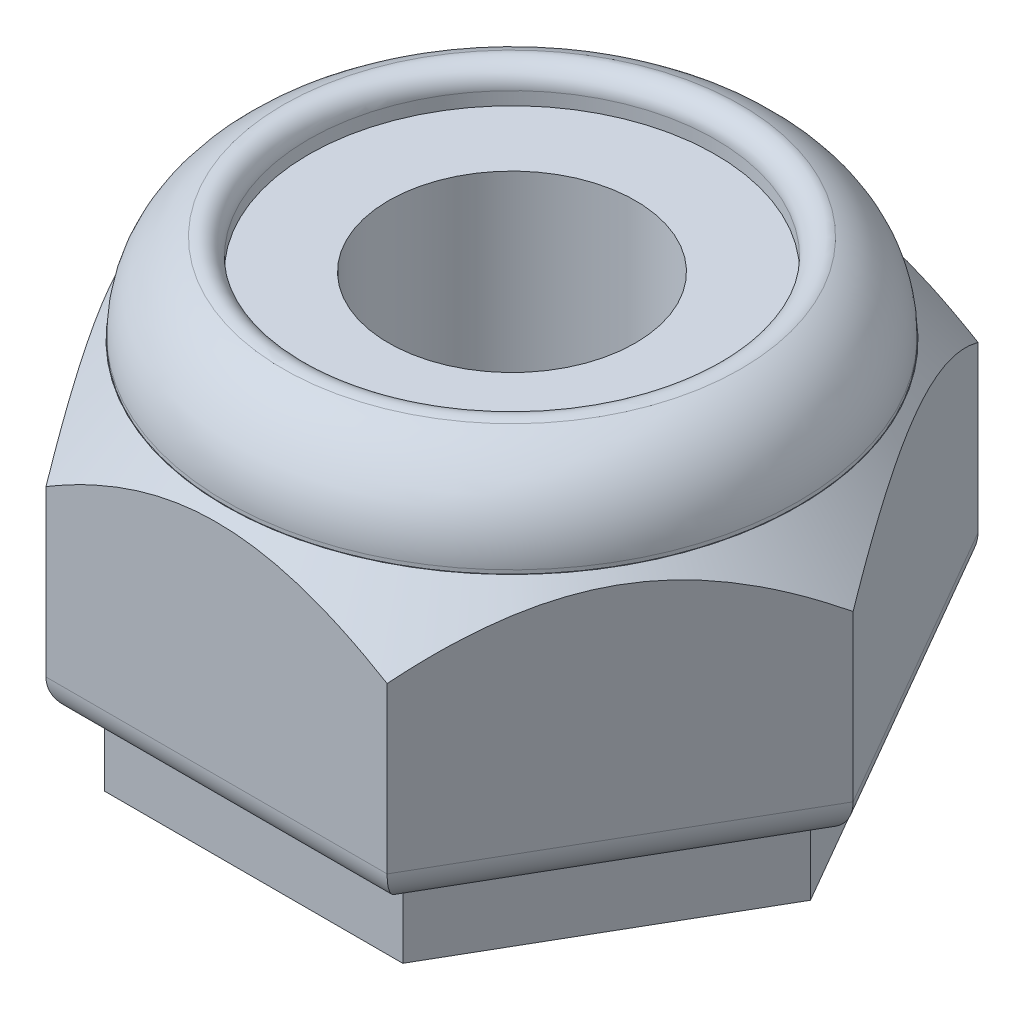
ISO-10303-21;
HEADER;
FILE_DESCRIPTION(('STEP AP214'),'2;1');
FILE_NAME('part.step','',(''),(''),'','','');
FILE_SCHEMA(('AUTOMOTIVE_DESIGN { 1 0 10303 214 1 1 1 1 }'));
ENDSEC;
DATA;
#1=APPLICATION_CONTEXT('core data for automotive mechanical design processes');
#2=APPLICATION_PROTOCOL_DEFINITION('international standard','automotive_design',2000,#1);
#3=PRODUCT_CONTEXT('',#1,'mechanical');
#4=PRODUCT('Part','Part','',(#3));
#5=PRODUCT_RELATED_PRODUCT_CATEGORY('part','',(#4));
#6=PRODUCT_DEFINITION_FORMATION('','',#4);
#7=PRODUCT_DEFINITION_CONTEXT('part definition',#1,'design');
#8=PRODUCT_DEFINITION('design','',#6,#7);
#9=PRODUCT_DEFINITION_SHAPE('','',#8);
#10=(LENGTH_UNIT() NAMED_UNIT(*) SI_UNIT(.MILLI.,.METRE.));
#11=(NAMED_UNIT(*) PLANE_ANGLE_UNIT() SI_UNIT($,.RADIAN.));
#12=(NAMED_UNIT(*) SI_UNIT($,.STERADIAN.) SOLID_ANGLE_UNIT());
#13=UNCERTAINTY_MEASURE_WITH_UNIT(LENGTH_MEASURE(1.E-05),#10,'distance_accuracy_value','');
#14=(GEOMETRIC_REPRESENTATION_CONTEXT(3) GLOBAL_UNCERTAINTY_ASSIGNED_CONTEXT((#13)) GLOBAL_UNIT_ASSIGNED_CONTEXT((#10,
#11,#12)) REPRESENTATION_CONTEXT('',''));
#15=CARTESIAN_POINT('',(0.,0.,0.));
#16=DIRECTION('',(0.,0.,1.));
#17=DIRECTION('',(1.,0.,0.));
#18=AXIS2_PLACEMENT_3D('',#15,#16,#17);
#19=CARTESIAN_POINT('',(0.,4.97840000000001,0.));
#20=DIRECTION('',(0.,-1.,0.));
#21=DIRECTION('',(1.,0.,0.));
#22=AXIS2_PLACEMENT_3D('',#19,#20,#21);
#23=CYLINDRICAL_SURFACE('',#22,3.93700000000001);
#24=CARTESIAN_POINT('',(0.,3.7084,0.));
#25=DIRECTION('',(0.,1.,0.));
#26=DIRECTION('',(-1.,0.,0.));
#27=AXIS2_PLACEMENT_3D('',#24,#25,#26);
#28=CIRCLE('',#27,3.937);
#29=CARTESIAN_POINT('',(-3.937,3.7084,0.));
#30=VERTEX_POINT('',#29);
#31=EDGE_CURVE('E142',#30,#30,#28,.T.);
#32=ORIENTED_EDGE('',*,*,#31,.F.);
#33=EDGE_LOOP('',(#32));
#34=FACE_BOUND('',#33,.T.);
#35=CARTESIAN_POINT('',(0.,3.6576,0.));
#36=DIRECTION('',(0.,-1.,0.));
#37=DIRECTION('',(1.,0.,0.));
#38=AXIS2_PLACEMENT_3D('',#35,#36,#37);
#39=CIRCLE('',#38,3.93700000000001);
#40=CARTESIAN_POINT('',(3.93700000000001,3.6576,0.));
#41=VERTEX_POINT('',#40);
#42=EDGE_CURVE('E20',#41,#41,#39,.F.);
#43=ORIENTED_EDGE('',*,*,#42,.T.);
#44=EDGE_LOOP('',(#43));
#45=FACE_BOUND('',#44,.T.);
#46=ADVANCED_FACE('F16',(#34,#45),#23,.T.);
#47=CARTESIAN_POINT('',(2.34315000000001,3.6576,4.05845484975502));
#48=DIRECTION('',(0.,-1.,0.));
#49=DIRECTION('',(1.,0.,0.));
#50=AXIS2_PLACEMENT_3D('',#47,#48,#49);
#51=PLANE('',#50);
#52=CARTESIAN_POINT('',(0.,3.65760000016735,0.));
#53=DIRECTION('',(0.,-1.,0.));
#54=DIRECTION('',(0.,0.,-1.));
#55=AXIS2_PLACEMENT_3D('',#52,#53,#54);
#56=CIRCLE('',#55,3.94407100938664);
#57=CARTESIAN_POINT('',(0.,3.65760000016735,-3.94407100938664));
#58=VERTEX_POINT('',#57);
#59=EDGE_CURVE('E141',#58,#58,#56,.T.);
#60=ORIENTED_EDGE('',*,*,#59,.F.);
#61=EDGE_LOOP('',(#60));
#62=FACE_BOUND('',#61,.T.);
#63=ORIENTED_EDGE('',*,*,#42,.F.);
#64=EDGE_LOOP('',(#63));
#65=FACE_BOUND('',#64,.T.);
#66=ADVANCED_FACE('F198',(#62,#65),#51,.F.);
#67=CARTESIAN_POINT('',(0.,3.70840000000008,0.));
#68=DIRECTION('',(0.,1.,0.));
#69=DIRECTION('',(0.,0.,1.));
#70=AXIS2_PLACEMENT_3D('',#67,#68,#69);
#71=TOROIDAL_SURFACE('',#70,2.66699999999999,1.27000000000001);
#72=ORIENTED_EDGE('',*,*,#31,.T.);
#73=EDGE_LOOP('',(#72));
#74=FACE_BOUND('',#73,.T.);
#75=CARTESIAN_POINT('',(0.,4.88572150982652,0.));
#76=DIRECTION('',(0.,1.,0.));
#77=DIRECTION('',(-1.,0.,0.));
#78=AXIS2_PLACEMENT_3D('',#75,#76,#77);
#79=CIRCLE('',#78,3.14325000000004);
#80=CARTESIAN_POINT('',(-3.14325000000003,4.88572150982652,0.));
#81=VERTEX_POINT('',#80);
#82=EDGE_CURVE('E121',#81,#81,#79,.T.);
#83=ORIENTED_EDGE('',*,*,#82,.F.);
#84=EDGE_LOOP('',(#83));
#85=FACE_BOUND('',#84,.T.);
#86=ADVANCED_FACE('F195',(#74,#85),#71,.T.);
#87=CARTESIAN_POINT('',(0.,2.76773860986168,0.));
#88=DIRECTION('',(0.,-1.,0.));
#89=DIRECTION('',(0.,0.,-1.));
#90=AXIS2_PLACEMENT_3D('',#87,#88,#89);
#91=CONICAL_SURFACE('',#90,4.69075337383629,0.698131700827581);
#92=CARTESIAN_POINT('',(-4.68630000002063,2.77304593408968,-5.5851817155357E-11));
#93=CARTESIAN_POINT('',(-4.65177717141987,2.81418235899122,0.0597952931143583));
#94=CARTESIAN_POINT('',(-4.61695780288894,2.85432113120693,0.120104208502788));
#95=CARTESIAN_POINT('',(-4.54666264441,2.93230661030783,0.241858994518482));
#96=CARTESIAN_POINT('',(-4.51118655193937,2.9701522247184,0.303305389130307));
#97=CARTESIAN_POINT('',(-4.40329561884235,3.0801870150985,0.490177966928205));
#98=CARTESIAN_POINT('',(-4.32983334003035,3.14837015585763,0.617418366271436));
#99=CARTESIAN_POINT('',(-4.17977964995295,3.27092778618679,0.877318981349457));
#100=CARTESIAN_POINT('',(-4.10317943930135,3.32525984895606,1.00999443806823));
#101=CARTESIAN_POINT('',(-3.94747591648453,3.41577217654512,1.2796808505042));
#102=CARTESIAN_POINT('',(-3.86837998240626,3.45200143021415,1.41667902699998));
#103=CARTESIAN_POINT('',(-3.73746585192525,3.49372811251008,1.64342895242181));
#104=CARTESIAN_POINT('',(-3.68614686015525,3.50560413722607,1.73231605356066));
#105=CARTESIAN_POINT('',(-3.58316406703978,3.52008140709636,1.910687483542));
#106=CARTESIAN_POINT('',(-3.53150020829175,3.52268106759616,2.00017191180866));
#107=CARTESIAN_POINT('',(-3.4285503454563,3.51847006530652,2.1784863048719));
#108=CARTESIAN_POINT('',(-3.37726380879505,3.51171021123823,2.26731719211343));
#109=CARTESIAN_POINT('',(-3.27519197702569,3.48921023560211,2.44411079075957));
#110=CARTESIAN_POINT('',(-3.224406707084,3.47346966546141,2.53207345857468));
#111=CARTESIAN_POINT('',(-3.10963060126893,3.42817062225528,2.73087150534129));
#112=CARTESIAN_POINT('',(-3.04589899568911,3.39598542078789,2.84125788425347));
#113=CARTESIAN_POINT('',(-2.92018166730183,3.32004827847368,3.05900668441208));
#114=CARTESIAN_POINT('',(-2.85819691952129,3.27629001415344,3.16636741686231));
#115=CARTESIAN_POINT('',(-2.7358890681865,3.1791036138555,3.37821082953874));
#116=CARTESIAN_POINT('',(-2.67557364726428,3.12563730729643,3.48268020305593));
#117=CARTESIAN_POINT('',(-2.55683004307658,3.01104764605198,3.68835015858288));
#118=CARTESIAN_POINT('',(-2.49840123076285,2.94992687744367,3.78955183013616));
#119=CARTESIAN_POINT('',(-2.42439626080902,2.86741854621722,3.91773219810881));
#120=CARTESIAN_POINT('',(-2.40802320097242,2.84883596647861,3.94609116962116));
#121=CARTESIAN_POINT('',(-2.3754621575828,2.81125673911825,4.00248855111944));
#122=CARTESIAN_POINT('',(-2.35927376439136,2.7922615116873,4.03052767061991));
#123=CARTESIAN_POINT('',(-2.34314999996957,2.77304593409365,4.05845484980773));
#124=B_SPLINE_CURVE_WITH_KNOTS('',3,(#92,#93,#94,#95,#96,#97,#98,#99,#100,#101,#102,#103,#104,
#105,#106,#107,#108,#109,#110,#111,#112,#113,#114,#115,#116,#117,#118,#119,#120,#121,#122,#123),
.UNSPECIFIED.,.F.,.F.,(4,2,2,2,2,2,2,2,2,2,2,2,2,2,2,4),(0.,0.241096809096306,0.482307589468028,
0.967637153878541,1.45443592247298,1.93991010962832,2.24950193441283,2.55914664334294,
2.86711700082692,3.17510274230014,3.56882084728694,3.96275452424868,4.35827201956431,
4.75365624709085,4.86660838996671,4.97921936903169),.UNSPECIFIED.);
#125=CARTESIAN_POINT('',(-4.68630000003129,2.77304593409263,1.36258849487727E-12));
#126=VERTEX_POINT('',#125);
#127=CARTESIAN_POINT('',(-2.34314999998476,2.77304593411176,4.05845484978141));
#128=VERTEX_POINT('',#127);
#129=EDGE_CURVE('E107',#126,#128,#124,.T.);
#130=ORIENTED_EDGE('',*,*,#129,.T.);
#131=CARTESIAN_POINT('',(-2.34315000006155,2.77304593408735,4.0584548497437));
#132=CARTESIAN_POINT('',(-2.27415972170866,2.81414935281164,4.05845484975083));
#133=CARTESIAN_POINT('',(-2.20457738522182,2.85425669894478,4.05845484975385));
#134=CARTESIAN_POINT('',(-2.06410193527611,2.93218331977878,4.05845484975614));
#135=CARTESIAN_POINT('',(-1.99320821640363,2.9700015014107,4.05845484975539));
#136=CARTESIAN_POINT('',(-1.77754688770714,3.07999086395974,4.05845484975419));
#137=CARTESIAN_POINT('',(-1.63068545867608,3.14815894046428,4.05845484975478));
#138=CARTESIAN_POINT('',(-1.3305275245436,3.27077676928304,4.05845484975521));
#139=CARTESIAN_POINT('',(-1.17720631605115,3.32516696813021,4.05845484975505));
#140=CARTESIAN_POINT('',(-0.86561350375334,3.41574608774384,4.05845484975494));
#141=CARTESIAN_POINT('',(-0.707359229251527,3.45199244882939,4.05845484975499));
#142=CARTESIAN_POINT('',(-0.456822143289689,3.49192146554132,4.058454849755));
#143=CARTESIAN_POINT('',(-0.365672921111748,3.50290887302486,4.058454849755));
#144=CARTESIAN_POINT('',(-0.183016321982132,3.51758027920227,4.058454849755));
#145=CARTESIAN_POINT('',(-0.0915105175139071,3.52128341043631,4.058454849755));
#146=CARTESIAN_POINT('',(0.104649468639837,3.52128177498356,4.058454849755));
#147=CARTESIAN_POINT('',(0.209305100868819,3.51643705340132,4.058454849755));
#148=CARTESIAN_POINT('',(0.417787181903716,3.49730239566766,4.058454849755));
#149=CARTESIAN_POINT('',(0.521613181345373,3.48300765118378,4.058454849755));
#150=CARTESIAN_POINT('',(0.728332544903489,3.44553375893286,4.058454849755));
#151=CARTESIAN_POINT('',(0.831215331547278,3.4222969773141,4.058454849755));
#152=CARTESIAN_POINT('',(1.03487580389782,3.36791830062304,4.058454849755));
#153=CARTESIAN_POINT('',(1.13565289467374,3.33677420329568,4.058454849755));
#154=CARTESIAN_POINT('',(1.33273383820815,3.26838741926302,4.058454849755));
#155=CARTESIAN_POINT('',(1.42908716224858,3.23128582693013,4.058454849755));
#156=CARTESIAN_POINT('',(1.61947291707491,3.15151071600647,4.058454849755));
#157=CARTESIAN_POINT('',(1.71350470709176,3.10883567908223,4.058454849755));
#158=CARTESIAN_POINT('',(1.89803195382149,3.01941532340772,4.058454849755));
#159=CARTESIAN_POINT('',(1.98855798046384,2.9727325573531,4.058454849755));
#160=CARTESIAN_POINT('',(2.16742834958516,2.87556944094008,4.058454849755));
#161=CARTESIAN_POINT('',(2.25577492893011,2.8250932194195,4.058454849755));
#162=CARTESIAN_POINT('',(2.34315000006327,2.77304593409223,4.058454849755));
#163=B_SPLINE_CURVE_WITH_KNOTS('',3,(#131,#132,#133,#134,#135,#136,#137,#138,#139,#140,#141,
#142,#143,#144,#145,#146,#147,#148,#149,#150,#151,#152,#153,#154,#155,#156,#157,#158,#159,#160,
#161,#162),.UNSPECIFIED.,.F.,.F.,(4,2,2,2,2,2,2,2,2,2,2,2,2,2,2,4),(0.,0.240903303567016,
0.481920744751272,0.967059466998938,1.45426068379578,1.93990959183257,2.21507934698528,
2.48952538388813,2.80337599595386,3.11738642358903,3.43345557970446,3.74961286053018,
4.05916118105052,4.36879400618447,4.67425708544416,4.97939238066899),.UNSPECIFIED.);
#164=CARTESIAN_POINT('',(2.34315000001685,2.77304593409264,4.05845484978141));
#165=VERTEX_POINT('',#164);
#166=EDGE_CURVE('E175',#128,#165,#163,.T.);
#167=ORIENTED_EDGE('',*,*,#166,.T.);
#168=CARTESIAN_POINT('',(2.34314999996197,2.77304593408969,4.05845484980079));
#169=CARTESIAN_POINT('',(2.37767282857373,2.81418235899124,3.99865955663693));
#170=CARTESIAN_POINT('',(2.41249219710932,2.85432113120694,3.93835064125119));
#171=CARTESIAN_POINT('',(2.48278735559178,2.93230661030784,3.81659585523753));
#172=CARTESIAN_POINT('',(2.51826344806127,2.97015222471841,3.75514946062505));
#173=CARTESIAN_POINT('',(2.62615438115643,3.0801870150985,3.56827688282608));
#174=CARTESIAN_POINT('',(2.69961665996934,3.14837015585764,3.44103648348338));
#175=CARTESIAN_POINT('',(2.8496703500474,3.27092778618679,3.18113586840574));
#176=CARTESIAN_POINT('',(2.92627056069876,3.32525984895606,3.04846041168683));
#177=CARTESIAN_POINT('',(3.08197408351539,3.41577217654512,2.77877399925076));
#178=CARTESIAN_POINT('',(3.16107001759374,3.45200143021415,2.64177582275502));
#179=CARTESIAN_POINT('',(3.29198414807477,3.49372811251008,2.4150258973332));
#180=CARTESIAN_POINT('',(3.34330313984477,3.50560413722607,2.32613879619435));
#181=CARTESIAN_POINT('',(3.44628593296023,3.52008140709636,2.147767366213));
#182=CARTESIAN_POINT('',(3.49794979170827,3.52268106759615,2.05828293794635));
#183=CARTESIAN_POINT('',(3.60089965454371,3.51847006530651,1.87996854488311));
#184=CARTESIAN_POINT('',(3.65218619120497,3.51171021123823,1.79113765764158));
#185=CARTESIAN_POINT('',(3.75425802297432,3.48921023560211,1.61434405899544));
#186=CARTESIAN_POINT('',(3.80504329291601,3.47346966546141,1.52638139118033));
#187=CARTESIAN_POINT('',(3.91981939873108,3.42817062225528,1.32758334441373));
#188=CARTESIAN_POINT('',(3.98355100431089,3.39598542078789,1.21719696550155));
#189=CARTESIAN_POINT('',(4.10926833269818,3.32004827847368,0.999448165342945));
#190=CARTESIAN_POINT('',(4.17125308047872,3.27629001415344,0.892087432892712));
#191=CARTESIAN_POINT('',(4.2935609318135,3.17910361385551,0.680244020216284));
#192=CARTESIAN_POINT('',(4.35387635273573,3.12563730729643,0.575774646699087));
#193=CARTESIAN_POINT('',(4.47261995692343,3.01104764605197,0.370104691172138));
#194=CARTESIAN_POINT('',(4.53104876923716,2.94992687744367,0.268903019618855));
#195=CARTESIAN_POINT('',(4.60505373919152,2.86741854621663,0.14072265164529));
#196=CARTESIAN_POINT('',(4.62142679902863,2.84883596647742,0.112363680132042));
#197=CARTESIAN_POINT('',(4.65398784241929,2.81125673911583,0.055966298631973));
#198=CARTESIAN_POINT('',(4.67017623561123,2.79226151168425,0.0279271791306273));
#199=CARTESIAN_POINT('',(4.68630000003353,2.77304593408996,-5.80666998558344E-11));
#200=B_SPLINE_CURVE_WITH_KNOTS('',3,(#168,#169,#170,#171,#172,#173,#174,#175,#176,#177,#178,
#179,#180,#181,#182,#183,#184,#185,#186,#187,#188,#189,#190,#191,#192,#193,#194,#195,#196,#197,
#198,#199),.UNSPECIFIED.,.F.,.F.,(4,2,2,2,2,2,2,2,2,2,2,2,2,2,2,4),(0.,0.241096809096303,
0.482307589468021,0.967637153878527,1.45443592247296,1.9399101096283,2.24950193441281,
2.55914664334292,2.8671170008269,3.17510274230012,3.56882084728691,3.96275452424864,
4.35827201956428,4.75365624709083,4.86660838997029,4.97921936903886),.UNSPECIFIED.);
#201=CARTESIAN_POINT('',(4.68630000002732,2.77304593409736,-1.0917840877275E-11));
#202=VERTEX_POINT('',#201);
#203=EDGE_CURVE('E182',#165,#202,#200,.T.);
#204=ORIENTED_EDGE('',*,*,#203,.T.);
#205=CARTESIAN_POINT('',(4.68630000001692,2.77304593410323,3.76267458844408E-11));
#206=CARTESIAN_POINT('',(4.65177717141278,2.8141823590028,-0.0597952931310414));
#207=CARTESIAN_POINT('',(4.61695780288054,2.85432113121737,-0.120104208518577));
#208=CARTESIAN_POINT('',(4.54666264440093,2.93230661031677,-0.241858994533079));
#209=CARTESIAN_POINT('',(4.51118655193091,2.97015222472698,-0.303305389144605));
#210=CARTESIAN_POINT('',(4.40329561883524,3.08018701510582,-0.490177966941427));
#211=CARTESIAN_POINT('',(4.32983334002344,3.14837015586387,-0.617418366283689));
#212=CARTESIAN_POINT('',(4.17977964994688,3.27092778619112,-0.877318981359809));
#213=CARTESIAN_POINT('',(4.10317943929591,3.32525984895958,-1.00999443807765));
#214=CARTESIAN_POINT('',(3.94747591648032,3.41577217654717,-1.27968085051162));
#215=CARTESIAN_POINT('',(3.86837998240263,3.45200143021556,-1.41667902700633));
#216=CARTESIAN_POINT('',(3.73746585192226,3.49372811251083,-1.64342895242706));
#217=CARTESIAN_POINT('',(3.68614686015226,3.50560413722664,-1.7323160535659));
#218=CARTESIAN_POINT('',(3.58316406703681,3.52008140709656,-1.91068748354721));
#219=CARTESIAN_POINT('',(3.53150020828879,3.52268106759618,-2.00017191181384));
#220=CARTESIAN_POINT('',(3.42855034545338,3.51847006530618,-2.17848630487702));
#221=CARTESIAN_POINT('',(3.37726380879215,3.51171021123772,-2.26731719211852));
#222=CARTESIAN_POINT('',(3.27519197702284,3.48921023560127,-2.44411079076458));
#223=CARTESIAN_POINT('',(3.22440670708118,3.47346966546041,-2.53207345857964));
#224=CARTESIAN_POINT('',(3.10963060126602,3.42817062225387,-2.73087150534641));
#225=CARTESIAN_POINT('',(3.04589899568608,3.39598542078622,-2.84125788425879));
#226=CARTESIAN_POINT('',(2.92018166729857,3.32004827847145,-3.05900668441778));
#227=CARTESIAN_POINT('',(2.85819691951793,3.27629001415092,-3.1663674168682));
#228=CARTESIAN_POINT('',(2.73588906818295,3.17910361385241,-3.37821082954497));
#229=CARTESIAN_POINT('',(2.67557364726063,3.12563730729304,-3.48268020306233));
#230=CARTESIAN_POINT('',(2.55683004307275,3.01104764604801,-3.68835015858959));
#231=CARTESIAN_POINT('',(2.49840123075893,2.94992687743942,-3.78955183014302));
#232=CARTESIAN_POINT('',(2.42439626080543,2.8674185462131,-3.91773219811509));
#233=CARTESIAN_POINT('',(2.40802320096925,2.84883596647492,-3.94609116962672));
#234=CARTESIAN_POINT('',(2.37546215758045,2.81125673911543,-4.00248855112358));
#235=CARTESIAN_POINT('',(2.35927376438942,2.79226151168493,-4.03052767062335));
#236=CARTESIAN_POINT('',(2.34314999996803,2.77304593409174,-4.05845484981047));
#237=B_SPLINE_CURVE_WITH_KNOTS('',3,(#205,#206,#207,#208,#209,#210,#211,#212,#213,#214,#215,
#216,#217,#218,#219,#220,#221,#222,#223,#224,#225,#226,#227,#228,#229,#230,#231,#232,#233,#234,
#235,#236),.UNSPECIFIED.,.F.,.F.,(4,2,2,2,2,2,2,2,2,2,2,2,2,2,2,4),(0.,0.241096809094276,
0.482307589464009,0.967637153870556,1.45443592246103,1.93991010961239,2.2495019343968,
2.55914664332681,2.86711700081071,3.17510274228384,3.56882084727151,3.96275452423413,
4.35827201955063,4.75365624707804,4.86660838995109,4.97921936901329),.UNSPECIFIED.);
#238=CARTESIAN_POINT('',(2.34315000001448,2.77304593409259,-4.05845484978282));
#239=VERTEX_POINT('',#238);
#240=EDGE_CURVE('E202',#202,#239,#237,.T.);
#241=ORIENTED_EDGE('',*,*,#240,.T.);
#242=CARTESIAN_POINT('',(2.34315000005868,2.77304593408962,-4.058454849745));
#243=CARTESIAN_POINT('',(2.2741597217057,2.81414935281353,-4.05845484975135));
#244=CARTESIAN_POINT('',(2.20457738521886,2.85425669894645,-4.05845484975405));
#245=CARTESIAN_POINT('',(2.06410193527325,2.93218331978018,-4.05845484975609));
#246=CARTESIAN_POINT('',(1.99320821640086,2.97000150141205,-4.05845484975542));
#247=CARTESIAN_POINT('',(1.77754688770464,3.07999086396089,-4.05845484975435));
#248=CARTESIAN_POINT('',(1.63068545867372,3.14815894046526,-4.05845484975488));
#249=CARTESIAN_POINT('',(1.33052752454156,3.2707767692837,-4.05845484975526));
#250=CARTESIAN_POINT('',(1.17720631604929,3.32516696813074,-4.05845484975512));
#251=CARTESIAN_POINT('',(0.865613503751842,3.41574608774412,-4.05845484975502));
#252=CARTESIAN_POINT('',(0.707359229250219,3.45199244882957,-4.05845484975506));
#253=CARTESIAN_POINT('',(0.456822143288761,3.49192146554135,-4.05845484975507));
#254=CARTESIAN_POINT('',(0.365672921111005,3.50290887302485,-4.05845484975507));
#255=CARTESIAN_POINT('',(0.183016321981762,3.5175802792022,-4.05845484975507));
#256=CARTESIAN_POINT('',(0.0915105175137235,3.52128341043623,-4.05845484975507));
#257=CARTESIAN_POINT('',(-0.104649468639836,3.52128177498348,-4.05845484975507));
#258=CARTESIAN_POINT('',(-0.209305100868819,3.51643705340124,-4.05845484975507));
#259=CARTESIAN_POINT('',(-0.41778718190372,3.49730239566758,-4.05845484975507));
#260=CARTESIAN_POINT('',(-0.521613181345379,3.48300765118369,-4.05845484975507));
#261=CARTESIAN_POINT('',(-0.728332544903499,3.44553375893278,-4.05845484975507));
#262=CARTESIAN_POINT('',(-0.831215331547289,3.42229697731402,-4.05845484975507));
#263=CARTESIAN_POINT('',(-1.03487580389784,3.36791830062295,-4.05845484975507));
#264=CARTESIAN_POINT('',(-1.13565289467376,3.3367742032956,-4.05845484975507));
#265=CARTESIAN_POINT('',(-1.33273383820816,3.26838741926293,-4.05845484975507));
#266=CARTESIAN_POINT('',(-1.42908716224858,3.23128582693005,-4.05845484975507));
#267=CARTESIAN_POINT('',(-1.61947291707489,3.1515107160064,-4.05845484975507));
#268=CARTESIAN_POINT('',(-1.71350470709174,3.10883567908216,-4.05845484975507));
#269=CARTESIAN_POINT('',(-1.89803195382145,3.01941532340766,-4.05845484975507));
#270=CARTESIAN_POINT('',(-1.9885579804638,2.97273255735305,-4.05845484975507));
#271=CARTESIAN_POINT('',(-2.1674283495851,2.87556944094004,-4.05845484975507));
#272=CARTESIAN_POINT('',(-2.25577492893005,2.82509321941947,-4.05845484975507));
#273=CARTESIAN_POINT('',(-2.3431500000632,2.7730459340922,-4.05845484975507));
#274=B_SPLINE_CURVE_WITH_KNOTS('',3,(#242,#243,#244,#245,#246,#247,#248,#249,#250,#251,#252,
#253,#254,#255,#256,#257,#258,#259,#260,#261,#262,#263,#264,#265,#266,#267,#268,#269,#270,#271,
#272,#273),.UNSPECIFIED.,.F.,.F.,(4,2,2,2,2,2,2,2,2,2,2,2,2,2,2,4),(0.,0.240903303566687,
0.481920744750623,0.967059466997657,1.45426068379387,1.93990959183004,2.21507934698218,
2.48952538388447,2.80337599595021,3.11738642358539,3.43345557970082,3.74961286052654,
4.05916118104685,4.36879400618078,4.67425708544044,4.97939238066524),.UNSPECIFIED.);
#275=CARTESIAN_POINT('',(-2.34315000001679,2.77304593409261,-4.05845484978147));
#276=VERTEX_POINT('',#275);
#277=EDGE_CURVE('E110',#239,#276,#274,.T.);
#278=ORIENTED_EDGE('',*,*,#277,.T.);
#279=CARTESIAN_POINT('',(-2.34314999996192,2.77304593408966,-4.05845484980084));
#280=CARTESIAN_POINT('',(-2.37767282857368,2.81418235899121,-3.99865955663698));
#281=CARTESIAN_POINT('',(-2.41249219710928,2.85432113120691,-3.93835064125125));
#282=CARTESIAN_POINT('',(-2.48278735559174,2.93230661030781,-3.81659585523759));
#283=CARTESIAN_POINT('',(-2.51826344806123,2.97015222471838,-3.7551494606251));
#284=CARTESIAN_POINT('',(-2.62615438115639,3.08018701509849,-3.56827688282613));
#285=CARTESIAN_POINT('',(-2.6996166599693,3.14837015585762,-3.44103648348342));
#286=CARTESIAN_POINT('',(-2.84967035004737,3.27092778618678,-3.18113586840577));
#287=CARTESIAN_POINT('',(-2.92627056069873,3.32525984895606,-3.04846041168686));
#288=CARTESIAN_POINT('',(-3.08197408351537,3.41577217654512,-2.77877399925078));
#289=CARTESIAN_POINT('',(-3.16107001759372,3.45200143021415,-2.64177582275504));
#290=CARTESIAN_POINT('',(-3.29198414807476,3.49372811251009,-2.41502589733322));
#291=CARTESIAN_POINT('',(-3.34330313984475,3.50560413722608,-2.32613879619437));
#292=CARTESIAN_POINT('',(-3.44628593296022,3.52008140709636,-2.14776736621302));
#293=CARTESIAN_POINT('',(-3.49794979170825,3.52268106759616,-2.05828293794636));
#294=CARTESIAN_POINT('',(-3.6008996545437,3.51847006530652,-1.87996854488312));
#295=CARTESIAN_POINT('',(-3.65218619120495,3.51171021123824,-1.79113765764159));
#296=CARTESIAN_POINT('',(-3.7542580229743,3.48921023560212,-1.61434405899545));
#297=CARTESIAN_POINT('',(-3.80504329291599,3.47346966546142,-1.52638139118034));
#298=CARTESIAN_POINT('',(-3.91981939873106,3.42817062225528,-1.32758334441374));
#299=CARTESIAN_POINT('',(-3.98355100431088,3.3959854207879,-1.21719696550156));
#300=CARTESIAN_POINT('',(-4.10926833269817,3.32004827847369,-0.999448165342954));
#301=CARTESIAN_POINT('',(-4.1712530804787,3.27629001415345,-0.89208743289272));
#302=CARTESIAN_POINT('',(-4.29356093181349,3.17910361385552,-0.680244020216292));
#303=CARTESIAN_POINT('',(-4.35387635273571,3.12563730729644,-0.575774646699097));
#304=CARTESIAN_POINT('',(-4.47261995692341,3.01104764605199,-0.370104691172152));
#305=CARTESIAN_POINT('',(-4.53104876923714,2.94992687744368,-0.26890301961887));
#306=CARTESIAN_POINT('',(-4.60505373919125,2.86741854621693,-0.14072265164575));
#307=CARTESIAN_POINT('',(-4.62142679902811,2.84883596647801,-0.112363680132942));
#308=CARTESIAN_POINT('',(-4.65398784241826,2.81125673911702,-0.0559662986337416));
#309=CARTESIAN_POINT('',(-4.67017623560996,2.79226151168575,-0.0279271791328252));
#310=CARTESIAN_POINT('',(-4.68630000003201,2.77304593409177,5.54427484235605E-11));
#311=B_SPLINE_CURVE_WITH_KNOTS('',3,(#279,#280,#281,#282,#283,#284,#285,#286,#287,#288,#289,
#290,#291,#292,#293,#294,#295,#296,#297,#298,#299,#300,#301,#302,#303,#304,#305,#306,#307,#308,
#309,#310),.UNSPECIFIED.,.F.,.F.,(4,2,2,2,2,2,2,2,2,2,2,2,2,2,2,4),(0.,0.24109680909631,
0.482307589468037,0.967637153878559,1.45443592247301,1.93991010962836,2.24950193441287,
2.55914664334298,2.86711700082697,3.17510274230018,3.56882084728698,3.96275452424871,
4.35827201956434,4.75365624709089,4.86660838996859,4.97921936903541),.UNSPECIFIED.);
#312=EDGE_CURVE('E103',#276,#126,#311,.T.);
#313=ORIENTED_EDGE('',*,*,#312,.T.);
#314=EDGE_LOOP('',(#130,#167,#204,#241,#278,#313));
#315=FACE_BOUND('',#314,.T.);
#316=ORIENTED_EDGE('',*,*,#59,.T.);
#317=EDGE_LOOP('',(#316));
#318=FACE_BOUND('',#317,.T.);
#319=ADVANCED_FACE('F105',(#315,#318),#91,.T.);
#320=CARTESIAN_POINT('',(0.,4.65025720786122,0.));
#321=DIRECTION('',(0.,-1.,0.));
#322=DIRECTION('',(1.,0.,0.));
#323=AXIS2_PLACEMENT_3D('',#320,#321,#322);
#324=TOROIDAL_SURFACE('',#323,3.04800000000006,0.254);
#325=CARTESIAN_POINT('',(0.,4.65025720786115,0.));
#326=DIRECTION('',(0.,1.,0.));
#327=DIRECTION('',(-1.,0.,0.));
#328=AXIS2_PLACEMENT_3D('',#325,#326,#327);
#329=CIRCLE('',#328,2.79400000000001);
#330=CARTESIAN_POINT('',(-2.79400000000001,4.65025720786115,0.));
#331=VERTEX_POINT('',#330);
#332=EDGE_CURVE('E134',#331,#331,#329,.F.);
#333=ORIENTED_EDGE('',*,*,#332,.T.);
#334=EDGE_LOOP('',(#333));
#335=FACE_BOUND('',#334,.T.);
#336=ORIENTED_EDGE('',*,*,#82,.T.);
#337=EDGE_LOOP('',(#336));
#338=FACE_BOUND('',#337,.T.);
#339=ADVANCED_FACE('F18',(#335,#338),#324,.T.);
#340=CARTESIAN_POINT('',(-4.6863,3.6576,0.));
#341=DIRECTION('',(0.866025403784439,0.,-0.5));
#342=DIRECTION('',(-0.5,0.,-0.866025403784439));
#343=AXIS2_PLACEMENT_3D('',#340,#341,#342);
#344=PLANE('',#343);
#345=DIRECTION('',(0.,1.,0.));
#346=VECTOR('',#345,1.);
#347=CARTESIAN_POINT('',(-2.34315,3.6576,4.058454849755));
#348=LINE('',#347,#346);
#349=CARTESIAN_POINT('',(-2.34315000000001,0.507999999999995,4.05845484975499));
#350=VERTEX_POINT('',#349);
#351=EDGE_CURVE('E120',#350,#128,#348,.T.);
#352=ORIENTED_EDGE('',*,*,#351,.T.);
#353=ORIENTED_EDGE('',*,*,#129,.F.);
#354=DIRECTION('',(0.,1.,0.));
#355=VECTOR('',#354,1.);
#356=CARTESIAN_POINT('',(-4.6863000000071,3.6576,1.22922505507717E-11));
#357=LINE('',#356,#355);
#358=CARTESIAN_POINT('',(-4.68630000000355,0.507999999999995,6.14200530713038E-12));
#359=VERTEX_POINT('',#358);
#360=EDGE_CURVE('E114',#126,#359,#357,.F.);
#361=ORIENTED_EDGE('',*,*,#360,.T.);
#362=DIRECTION('',(-0.5,0.,-0.866025403784439));
#363=VECTOR('',#362,1.);
#364=CARTESIAN_POINT('',(-4.68630000000001,0.507999999999995,0.));
#365=LINE('',#364,#363);
#366=EDGE_CURVE('E137',#350,#359,#365,.T.);
#367=ORIENTED_EDGE('',*,*,#366,.F.);
#368=EDGE_LOOP('',(#352,#353,#361,#367));
#369=FACE_BOUND('',#368,.T.);
#370=ADVANCED_FACE('F117',(#369),#344,.F.);
#371=CARTESIAN_POINT('',(-2.34315,3.6576,-4.05845484975501));
#372=DIRECTION('',(0.866025403784439,0.,0.5));
#373=DIRECTION('',(0.5,0.,-0.866025403784439));
#374=AXIS2_PLACEMENT_3D('',#371,#372,#373);
#375=PLANE('',#374);
#376=ORIENTED_EDGE('',*,*,#360,.F.);
#377=ORIENTED_EDGE('',*,*,#312,.F.);
#378=DIRECTION('',(0.,1.,0.));
#379=VECTOR('',#378,1.);
#380=CARTESIAN_POINT('',(-2.34315000001417,3.6576,-4.05845484975507));
#381=LINE('',#380,#379);
#382=CARTESIAN_POINT('',(-2.34315000000708,0.507999999999994,-4.05845484975504));
#383=VERTEX_POINT('',#382);
#384=EDGE_CURVE('E129',#276,#383,#381,.F.);
#385=ORIENTED_EDGE('',*,*,#384,.T.);
#386=DIRECTION('',(0.5,0.,-0.866025403784439));
#387=VECTOR('',#386,1.);
#388=CARTESIAN_POINT('',(-2.34315,0.507999999999995,-4.05845484975502));
#389=LINE('',#388,#387);
#390=EDGE_CURVE('E126',#359,#383,#389,.T.);
#391=ORIENTED_EDGE('',*,*,#390,.F.);
#392=EDGE_LOOP('',(#376,#377,#385,#391));
#393=FACE_BOUND('',#392,.T.);
#394=ADVANCED_FACE('F124',(#393),#375,.F.);
#395=CARTESIAN_POINT('',(2.34315000000001,3.6576,-4.05845484975507));
#396=DIRECTION('',(0.,0.,1.));
#397=DIRECTION('',(1.,0.,0.));
#398=AXIS2_PLACEMENT_3D('',#395,#396,#397);
#399=PLANE('',#398);
#400=ORIENTED_EDGE('',*,*,#384,.F.);
#401=ORIENTED_EDGE('',*,*,#277,.F.);
#402=DIRECTION('',(0.,1.,0.));
#403=VECTOR('',#402,1.);
#404=CARTESIAN_POINT('',(2.34314999999293,3.6576,-4.05845484976733));
#405=LINE('',#404,#403);
#406=CARTESIAN_POINT('',(2.34314999999648,0.507999999999995,-4.05845484976118));
#407=VERTEX_POINT('',#406);
#408=EDGE_CURVE('E508',#239,#407,#405,.F.);
#409=ORIENTED_EDGE('',*,*,#408,.T.);
#410=DIRECTION('',(1.,0.,0.));
#411=VECTOR('',#410,1.);
#412=CARTESIAN_POINT('',(2.34315,0.507999999999994,-4.05845484975503));
#413=LINE('',#412,#411);
#414=EDGE_CURVE('E169',#383,#407,#413,.T.);
#415=ORIENTED_EDGE('',*,*,#414,.F.);
#416=EDGE_LOOP('',(#400,#401,#409,#415));
#417=FACE_BOUND('',#416,.T.);
#418=ADVANCED_FACE('F343',(#417),#399,.F.);
#419=CARTESIAN_POINT('',(4.68630000000002,3.6576,0.));
#420=DIRECTION('',(-0.866025403784439,0.,0.5));
#421=DIRECTION('',(0.5,0.,0.866025403784439));
#422=AXIS2_PLACEMENT_3D('',#419,#420,#421);
#423=PLANE('',#422);
#424=ORIENTED_EDGE('',*,*,#408,.F.);
#425=ORIENTED_EDGE('',*,*,#240,.F.);
#426=DIRECTION('',(0.,1.,0.));
#427=VECTOR('',#426,1.);
#428=CARTESIAN_POINT('',(4.68630000001422,3.6576,-2.46174608475869E-11));
#429=LINE('',#428,#427);
#430=CARTESIAN_POINT('',(4.68630000000712,0.508000000000008,-1.23196537606812E-11));
#431=VERTEX_POINT('',#430);
#432=EDGE_CURVE('E500',#202,#431,#429,.F.);
#433=ORIENTED_EDGE('',*,*,#432,.T.);
#434=DIRECTION('',(0.5,0.,0.866025403784439));
#435=VECTOR('',#434,1.);
#436=CARTESIAN_POINT('',(4.68630000000002,0.507999999999995,0.));
#437=LINE('',#436,#435);
#438=EDGE_CURVE('E165',#407,#431,#437,.T.);
#439=ORIENTED_EDGE('',*,*,#438,.F.);
#440=EDGE_LOOP('',(#424,#425,#433,#439));
#441=FACE_BOUND('',#440,.T.);
#442=ADVANCED_FACE('F349',(#441),#423,.F.);
#443=CARTESIAN_POINT('',(2.34315000000001,3.6576,4.05845484975502));
#444=DIRECTION('',(-0.866025403784439,0.,-0.499999999999999));
#445=DIRECTION('',(-0.499999999999999,0.,0.866025403784439));
#446=AXIS2_PLACEMENT_3D('',#443,#444,#445);
#447=PLANE('',#446);
#448=ORIENTED_EDGE('',*,*,#432,.F.);
#449=ORIENTED_EDGE('',*,*,#203,.F.);
#450=DIRECTION('',(0.,1.,0.));
#451=VECTOR('',#450,1.);
#452=CARTESIAN_POINT('',(2.34315000001423,3.6576,4.058454849755));
#453=LINE('',#452,#451);
#454=CARTESIAN_POINT('',(2.34315000000713,0.507999999999995,4.05845484975499));
#455=VERTEX_POINT('',#454);
#456=EDGE_CURVE('E138',#165,#455,#453,.F.);
#457=ORIENTED_EDGE('',*,*,#456,.T.);
#458=DIRECTION('',(-0.499999999999999,0.,0.866025403784439));
#459=VECTOR('',#458,1.);
#460=CARTESIAN_POINT('',(2.34315000000003,0.508000000000008,4.05845484975498));
#461=LINE('',#460,#459);
#462=EDGE_CURVE('E161',#431,#455,#461,.T.);
#463=ORIENTED_EDGE('',*,*,#462,.F.);
#464=EDGE_LOOP('',(#448,#449,#457,#463));
#465=FACE_BOUND('',#464,.T.);
#466=ADVANCED_FACE('F303',(#465),#447,.F.);
#467=CARTESIAN_POINT('',(-2.34315000000002,3.6576,4.058454849755));
#468=DIRECTION('',(0.,0.,-1.));
#469=DIRECTION('',(-1.,0.,0.));
#470=AXIS2_PLACEMENT_3D('',#467,#468,#469);
#471=PLANE('',#470);
#472=ORIENTED_EDGE('',*,*,#456,.F.);
#473=ORIENTED_EDGE('',*,*,#166,.F.);
#474=ORIENTED_EDGE('',*,*,#351,.F.);
#475=DIRECTION('',(-1.,0.,0.));
#476=VECTOR('',#475,1.);
#477=CARTESIAN_POINT('',(-2.34315,0.507999999999995,4.05845484975498));
#478=LINE('',#477,#476);
#479=EDGE_CURVE('E157',#455,#350,#478,.T.);
#480=ORIENTED_EDGE('',*,*,#479,.F.);
#481=EDGE_LOOP('',(#472,#473,#474,#480));
#482=FACE_BOUND('',#481,.T.);
#483=ADVANCED_FACE('F188',(#482),#471,.F.);
#484=CARTESIAN_POINT('',(0.,4.4704,0.));
#485=DIRECTION('',(0.,1.,0.));
#486=DIRECTION('',(-1.,0.,0.));
#487=AXIS2_PLACEMENT_3D('',#484,#485,#486);
#488=CYLINDRICAL_SURFACE('',#487,2.79400000000001);
#489=ORIENTED_EDGE('',*,*,#332,.F.);
#490=EDGE_LOOP('',(#489));
#491=FACE_BOUND('',#490,.T.);
#492=CARTESIAN_POINT('',(0.,4.4704,0.));
#493=DIRECTION('',(0.,1.,0.));
#494=DIRECTION('',(-1.,0.,0.));
#495=AXIS2_PLACEMENT_3D('',#492,#493,#494);
#496=CIRCLE('',#495,2.79400000000001);
#497=CARTESIAN_POINT('',(-2.79400000000001,4.4704,0.));
#498=VERTEX_POINT('',#497);
#499=EDGE_CURVE('E150',#498,#498,#496,.T.);
#500=ORIENTED_EDGE('',*,*,#499,.F.);
#501=EDGE_LOOP('',(#500));
#502=FACE_BOUND('',#501,.T.);
#503=ADVANCED_FACE('F296',(#491,#502),#488,.F.);
#504=CARTESIAN_POINT('',(-4.24635909487751,0.507999999999995,-0.254000000000011));
#505=DIRECTION('',(-0.5,0.,-0.866025403784439));
#506=DIRECTION('',(-0.866025403784439,0.,0.5));
#507=AXIS2_PLACEMENT_3D('',#504,#505,#506);
#508=CYLINDRICAL_SURFACE('',#507,0.508000000000002);
#509=CARTESIAN_POINT('',(-4.09971212650334,0.507999999999995,0.));
#510=DIRECTION('',(0.,0.,-1.));
#511=DIRECTION('',(1.,0.,0.));
#512=AXIS2_PLACEMENT_3D('',#509,#510,#511);
#513=ELLIPSE('',#512,0.586587873496662,0.508000000000002);
#514=CARTESIAN_POINT('',(-4.09971212650335,0.,0.));
#515=VERTEX_POINT('',#514);
#516=EDGE_CURVE('E173',#515,#359,#513,.T.);
#517=ORIENTED_EDGE('',*,*,#516,.F.);
#518=DIRECTION('',(-0.5,0.,-0.866025403784439));
#519=VECTOR('',#518,1.);
#520=CARTESIAN_POINT('',(-2.04985606325168,0.,3.55045484975499));
#521=LINE('',#520,#519);
#522=CARTESIAN_POINT('',(-2.04985606325168,0.,3.55045484975498));
#523=VERTEX_POINT('',#522);
#524=EDGE_CURVE('E153',#515,#523,#521,.F.);
#525=ORIENTED_EDGE('',*,*,#524,.T.);
#526=CARTESIAN_POINT('',(-2.04985606325169,0.507999999999995,3.55045484975498));
#527=DIRECTION('',(-0.866025403784438,0.,-0.5));
#528=DIRECTION('',(-0.5,0.,0.866025403784438));
#529=AXIS2_PLACEMENT_3D('',#526,#527,#528);
#530=ELLIPSE('',#529,0.586587873496662,0.508000000000002);
#531=EDGE_CURVE('E154',#350,#523,#530,.F.);
#532=ORIENTED_EDGE('',*,*,#531,.F.);
#533=ORIENTED_EDGE('',*,*,#366,.T.);
#534=EDGE_LOOP('',(#517,#525,#532,#533));
#535=FACE_BOUND('',#534,.T.);
#536=ADVANCED_FACE('F293',(#535),#508,.T.);
#537=CARTESIAN_POINT('',(-1.9032090948775,0.507999999999995,-3.80445484975502));
#538=DIRECTION('',(0.5,0.,-0.866025403784439));
#539=DIRECTION('',(-0.866025403784439,0.,-0.5));
#540=AXIS2_PLACEMENT_3D('',#537,#538,#539);
#541=CYLINDRICAL_SURFACE('',#540,0.508000000000002);
#542=CARTESIAN_POINT('',(-2.04985606325166,0.508000000000002,-3.55045484975503));
#543=DIRECTION('',(0.866025403784439,0.,-0.5));
#544=DIRECTION('',(0.5,0.,0.866025403784439));
#545=AXIS2_PLACEMENT_3D('',#542,#543,#544);
#546=ELLIPSE('',#545,0.586587873496661,0.508000000000002);
#547=CARTESIAN_POINT('',(-2.04985606325168,0.,-3.55045484975506));
#548=VERTEX_POINT('',#547);
#549=EDGE_CURVE('E170',#548,#383,#546,.T.);
#550=ORIENTED_EDGE('',*,*,#549,.F.);
#551=DIRECTION('',(0.5,0.,-0.866025403784439));
#552=VECTOR('',#551,1.);
#553=CARTESIAN_POINT('',(-4.09971212650335,0.,0.));
#554=LINE('',#553,#552);
#555=EDGE_CURVE('E530',#548,#515,#554,.F.);
#556=ORIENTED_EDGE('',*,*,#555,.T.);
#557=ORIENTED_EDGE('',*,*,#516,.T.);
#558=ORIENTED_EDGE('',*,*,#390,.T.);
#559=EDGE_LOOP('',(#550,#556,#557,#558));
#560=FACE_BOUND('',#559,.T.);
#561=ADVANCED_FACE('F289',(#560),#541,.T.);
#562=CARTESIAN_POINT('',(2.34315,0.508000000000008,-3.55045484975503));
#563=DIRECTION('',(1.,0.,0.));
#564=DIRECTION('',(0.,1.,0.));
#565=AXIS2_PLACEMENT_3D('',#562,#563,#564);
#566=CYLINDRICAL_SURFACE('',#565,0.508000000000002);
#567=CARTESIAN_POINT('',(2.04985606325169,0.508000000000002,-3.55045484975503));
#568=DIRECTION('',(0.866025403784438,0.,0.5));
#569=DIRECTION('',(-0.5,0.,0.866025403784439));
#570=AXIS2_PLACEMENT_3D('',#567,#568,#569);
#571=ELLIPSE('',#570,0.586587873496662,0.508000000000002);
#572=CARTESIAN_POINT('',(2.04985606325168,0.,-3.55045484975508));
#573=VERTEX_POINT('',#572);
#574=EDGE_CURVE('E166',#573,#407,#571,.T.);
#575=ORIENTED_EDGE('',*,*,#574,.F.);
#576=DIRECTION('',(1.,0.,0.));
#577=VECTOR('',#576,1.);
#578=CARTESIAN_POINT('',(-2.04985606325165,0.,-3.55045484975508));
#579=LINE('',#578,#577);
#580=EDGE_CURVE('E519',#573,#548,#579,.F.);
#581=ORIENTED_EDGE('',*,*,#580,.T.);
#582=ORIENTED_EDGE('',*,*,#549,.T.);
#583=ORIENTED_EDGE('',*,*,#414,.T.);
#584=EDGE_LOOP('',(#575,#581,#582,#583));
#585=FACE_BOUND('',#584,.T.);
#586=ADVANCED_FACE('F285',(#585),#566,.T.);
#587=CARTESIAN_POINT('',(4.24635909487753,0.507999999999995,0.253999999999983));
#588=DIRECTION('',(0.5,0.,0.866025403784439));
#589=DIRECTION('',(0.866025403784439,0.,-0.5));
#590=AXIS2_PLACEMENT_3D('',#587,#588,#589);
#591=CYLINDRICAL_SURFACE('',#590,0.508000000000002);
#592=ORIENTED_EDGE('',*,*,#574,.T.);
#593=ORIENTED_EDGE('',*,*,#438,.T.);
#594=CARTESIAN_POINT('',(4.09971212650336,0.508000000000002,0.));
#595=DIRECTION('',(0.,0.,1.));
#596=DIRECTION('',(-1.,0.,0.));
#597=AXIS2_PLACEMENT_3D('',#594,#595,#596);
#598=ELLIPSE('',#597,0.586587873496662,0.508000000000002);
#599=CARTESIAN_POINT('',(4.09971212650335,0.,0.));
#600=VERTEX_POINT('',#599);
#601=EDGE_CURVE('E162',#600,#431,#598,.T.);
#602=ORIENTED_EDGE('',*,*,#601,.F.);
#603=DIRECTION('',(0.5,0.,0.866025403784439));
#604=VECTOR('',#603,1.);
#605=CARTESIAN_POINT('',(2.04985606325167,0.,-3.55045484975502));
#606=LINE('',#605,#604);
#607=EDGE_CURVE('E583',#600,#573,#606,.F.);
#608=ORIENTED_EDGE('',*,*,#607,.T.);
#609=EDGE_LOOP('',(#592,#593,#602,#608));
#610=FACE_BOUND('',#609,.T.);
#611=ADVANCED_FACE('F281',(#610),#591,.T.);
#612=CARTESIAN_POINT('',(1.90320909487753,0.508000000000008,3.80445484975498));
#613=DIRECTION('',(-0.499999999999999,0.,0.866025403784439));
#614=DIRECTION('',(0.866025403784439,0.,0.499999999999999));
#615=AXIS2_PLACEMENT_3D('',#612,#613,#614);
#616=CYLINDRICAL_SURFACE('',#615,0.508000000000002);
#617=ORIENTED_EDGE('',*,*,#601,.T.);
#618=ORIENTED_EDGE('',*,*,#462,.T.);
#619=CARTESIAN_POINT('',(2.0498560632517,0.508000000000002,3.55045484975498));
#620=DIRECTION('',(-0.866025403784439,0.,0.5));
#621=DIRECTION('',(-0.5,0.,-0.866025403784439));
#622=AXIS2_PLACEMENT_3D('',#619,#620,#621);
#623=ELLIPSE('',#622,0.586587873496662,0.508000000000002);
#624=CARTESIAN_POINT('',(2.0498560632517,0.,3.55045484975498));
#625=VERTEX_POINT('',#624);
#626=EDGE_CURVE('E158',#625,#455,#623,.T.);
#627=ORIENTED_EDGE('',*,*,#626,.F.);
#628=DIRECTION('',(-0.499999999999999,0.,0.866025403784439));
#629=VECTOR('',#628,1.);
#630=CARTESIAN_POINT('',(4.09971212650336,0.,0.));
#631=LINE('',#630,#629);
#632=EDGE_CURVE('E559',#625,#600,#631,.F.);
#633=ORIENTED_EDGE('',*,*,#632,.T.);
#634=EDGE_LOOP('',(#617,#618,#627,#633));
#635=FACE_BOUND('',#634,.T.);
#636=ADVANCED_FACE('F277',(#635),#616,.T.);
#637=CARTESIAN_POINT('',(-2.34315,0.507999999999995,3.55045484975498));
#638=DIRECTION('',(-1.,0.,0.));
#639=DIRECTION('',(0.,0.,1.));
#640=AXIS2_PLACEMENT_3D('',#637,#638,#639);
#641=CYLINDRICAL_SURFACE('',#640,0.508000000000002);
#642=ORIENTED_EDGE('',*,*,#531,.T.);
#643=DIRECTION('',(-1.,0.,0.));
#644=VECTOR('',#643,1.);
#645=CARTESIAN_POINT('',(2.04985606325167,0.,3.55045484975498));
#646=LINE('',#645,#644);
#647=EDGE_CURVE('E149',#523,#625,#646,.F.);
#648=ORIENTED_EDGE('',*,*,#647,.T.);
#649=ORIENTED_EDGE('',*,*,#626,.T.);
#650=ORIENTED_EDGE('',*,*,#479,.T.);
#651=EDGE_LOOP('',(#642,#648,#649,#650));
#652=FACE_BOUND('',#651,.T.);
#653=ADVANCED_FACE('F273',(#652),#641,.T.);
#654=CARTESIAN_POINT('',(0.,4.4704,0.));
#655=DIRECTION('',(0.,1.,0.));
#656=DIRECTION('',(-1.,0.,0.));
#657=AXIS2_PLACEMENT_3D('',#654,#655,#656);
#658=PLANE('',#657);
#659=ORIENTED_EDGE('',*,*,#499,.T.);
#660=EDGE_LOOP('',(#659));
#661=FACE_BOUND('',#660,.T.);
#662=CARTESIAN_POINT('',(0.,4.4704,0.));
#663=DIRECTION('',(0.,1.,0.));
#664=DIRECTION('',(-1.,0.,0.));
#665=AXIS2_PLACEMENT_3D('',#662,#663,#664);
#666=CIRCLE('',#665,1.69545000000001);
#667=CARTESIAN_POINT('',(-1.69545000000001,4.4704,0.));
#668=VERTEX_POINT('',#667);
#669=EDGE_CURVE('E145',#668,#668,#666,.F.);
#670=ORIENTED_EDGE('',*,*,#669,.T.);
#671=EDGE_LOOP('',(#670));
#672=FACE_BOUND('',#671,.T.);
#673=ADVANCED_FACE('F269',(#661,#672),#658,.T.);
#674=CARTESIAN_POINT('',(-2.04985606325168,-0.956309999999953,3.55045484975499));
#675=DIRECTION('',(0.866025403784439,0.,-0.5));
#676=DIRECTION('',(-0.5,0.,-0.866025403784439));
#677=AXIS2_PLACEMENT_3D('',#674,#675,#676);
#678=PLANE('',#677);
#679=DIRECTION('',(0.,1.,0.));
#680=VECTOR('',#679,1.);
#681=CARTESIAN_POINT('',(-4.09971212650335,-0.956309999999919,0.));
#682=LINE('',#681,#680);
#683=CARTESIAN_POINT('',(-4.09971212650335,-0.956309999999924,0.));
#684=VERTEX_POINT('',#683);
#685=EDGE_CURVE('E532',#515,#684,#682,.F.);
#686=ORIENTED_EDGE('',*,*,#685,.T.);
#687=DIRECTION('',(-0.500000000000002,0.,-0.866025403784438));
#688=VECTOR('',#687,1.);
#689=CARTESIAN_POINT('',(-2.04985606325168,-0.956309999999919,3.55045484975499));
#690=LINE('',#689,#688);
#691=CARTESIAN_POINT('',(-2.04985606325168,-0.956309999999936,3.55045484975498));
#692=VERTEX_POINT('',#691);
#693=EDGE_CURVE('E148',#692,#684,#690,.T.);
#694=ORIENTED_EDGE('',*,*,#693,.F.);
#695=DIRECTION('',(0.,1.,0.));
#696=VECTOR('',#695,1.);
#697=CARTESIAN_POINT('',(-2.04985606325168,-0.956309999999919,3.55045484975498));
#698=LINE('',#697,#696);
#699=EDGE_CURVE('E555',#692,#523,#698,.T.);
#700=ORIENTED_EDGE('',*,*,#699,.T.);
#701=ORIENTED_EDGE('',*,*,#524,.F.);
#702=EDGE_LOOP('',(#686,#694,#700,#701));
#703=FACE_BOUND('',#702,.T.);
#704=ADVANCED_FACE('F265',(#703),#678,.F.);
#705=CARTESIAN_POINT('',(-4.09971212650335,-0.956309999999919,0.));
#706=DIRECTION('',(0.866025403784439,0.,0.5));
#707=DIRECTION('',(0.5,0.,-0.866025403784439));
#708=AXIS2_PLACEMENT_3D('',#705,#706,#707);
#709=PLANE('',#708);
#710=DIRECTION('',(0.,1.,0.));
#711=VECTOR('',#710,1.);
#712=CARTESIAN_POINT('',(-2.04985606325166,-0.956309999999912,-3.55045484975508));
#713=LINE('',#712,#711);
#714=CARTESIAN_POINT('',(-2.04985606325165,-0.956309999999918,-3.55045484975508));
#715=VERTEX_POINT('',#714);
#716=EDGE_CURVE('E523',#548,#715,#713,.F.);
#717=ORIENTED_EDGE('',*,*,#716,.T.);
#718=DIRECTION('',(0.499999999999997,0.,-0.866025403784441));
#719=VECTOR('',#718,1.);
#720=CARTESIAN_POINT('',(-4.09971212650335,-0.956309999999919,0.));
#721=LINE('',#720,#719);
#722=EDGE_CURVE('E538',#684,#715,#721,.T.);
#723=ORIENTED_EDGE('',*,*,#722,.F.);
#724=ORIENTED_EDGE('',*,*,#685,.F.);
#725=ORIENTED_EDGE('',*,*,#555,.F.);
#726=EDGE_LOOP('',(#717,#723,#724,#725));
#727=FACE_BOUND('',#726,.T.);
#728=ADVANCED_FACE('F261',(#727),#709,.F.);
#729=CARTESIAN_POINT('',(-2.04985606325165,-0.956309999999912,-3.55045484975508));
#730=DIRECTION('',(0.,0.,1.));
#731=DIRECTION('',(1.,0.,0.));
#732=AXIS2_PLACEMENT_3D('',#729,#730,#731);
#733=PLANE('',#732);
#734=DIRECTION('',(0.,1.,0.));
#735=VECTOR('',#734,1.);
#736=CARTESIAN_POINT('',(2.04985606325166,-0.956309999999919,-3.55045484975505));
#737=LINE('',#736,#735);
#738=CARTESIAN_POINT('',(2.04985606325165,-0.956309999999917,-3.55045484975506));
#739=VERTEX_POINT('',#738);
#740=EDGE_CURVE('E522',#573,#739,#737,.F.);
#741=ORIENTED_EDGE('',*,*,#740,.T.);
#742=DIRECTION('',(1.,0.,0.));
#743=VECTOR('',#742,1.);
#744=CARTESIAN_POINT('',(-4.09971212650335,-0.956309999999919,-3.55045484975508));
#745=LINE('',#744,#743);
#746=EDGE_CURVE('E527',#715,#739,#745,.T.);
#747=ORIENTED_EDGE('',*,*,#746,.F.);
#748=ORIENTED_EDGE('',*,*,#716,.F.);
#749=ORIENTED_EDGE('',*,*,#580,.F.);
#750=EDGE_LOOP('',(#741,#747,#748,#749));
#751=FACE_BOUND('',#750,.T.);
#752=ADVANCED_FACE('F257',(#751),#733,.F.);
#753=CARTESIAN_POINT('',(2.04985606325167,-0.956309999999919,-3.55045484975502));
#754=DIRECTION('',(-0.866025403784439,0.,0.5));
#755=DIRECTION('',(0.5,0.,0.866025403784439));
#756=AXIS2_PLACEMENT_3D('',#753,#754,#755);
#757=PLANE('',#756);
#758=DIRECTION('',(0.,1.,0.));
#759=VECTOR('',#758,1.);
#760=CARTESIAN_POINT('',(4.09971212650336,-0.956309999999919,0.));
#761=LINE('',#760,#759);
#762=CARTESIAN_POINT('',(4.09971212650336,-0.956309999999919,0.));
#763=VERTEX_POINT('',#762);
#764=EDGE_CURVE('E563',#600,#763,#761,.F.);
#765=ORIENTED_EDGE('',*,*,#764,.T.);
#766=DIRECTION('',(0.500000000000006,0.,0.866025403784435));
#767=VECTOR('',#766,1.);
#768=CARTESIAN_POINT('',(2.04985606325167,-0.956309999999919,-3.55045484975502));
#769=LINE('',#768,#767);
#770=EDGE_CURVE('E579',#739,#763,#769,.T.);
#771=ORIENTED_EDGE('',*,*,#770,.F.);
#772=ORIENTED_EDGE('',*,*,#740,.F.);
#773=ORIENTED_EDGE('',*,*,#607,.F.);
#774=EDGE_LOOP('',(#765,#771,#772,#773));
#775=FACE_BOUND('',#774,.T.);
#776=ADVANCED_FACE('F254',(#775),#757,.F.);
#777=CARTESIAN_POINT('',(4.09971212650336,-0.956309999999919,0.));
#778=DIRECTION('',(-0.866025403784439,0.,-0.499999999999999));
#779=DIRECTION('',(-0.499999999999999,0.,0.866025403784439));
#780=AXIS2_PLACEMENT_3D('',#777,#778,#779);
#781=PLANE('',#780);
#782=DIRECTION('',(0.,1.,0.));
#783=VECTOR('',#782,1.);
#784=CARTESIAN_POINT('',(2.04985606325171,-0.956309999999919,3.55045484975498));
#785=LINE('',#784,#783);
#786=CARTESIAN_POINT('',(2.0498560632517,-0.956309999999919,3.55045484975498));
#787=VERTEX_POINT('',#786);
#788=EDGE_CURVE('E35',#625,#787,#785,.F.);
#789=ORIENTED_EDGE('',*,*,#788,.T.);
#790=DIRECTION('',(-0.500000000000003,0.,0.866025403784437));
#791=VECTOR('',#790,1.);
#792=CARTESIAN_POINT('',(4.09971212650336,-0.956309999999919,0.));
#793=LINE('',#792,#791);
#794=EDGE_CURVE('E575',#763,#787,#793,.T.);
#795=ORIENTED_EDGE('',*,*,#794,.F.);
#796=ORIENTED_EDGE('',*,*,#764,.F.);
#797=ORIENTED_EDGE('',*,*,#632,.F.);
#798=EDGE_LOOP('',(#789,#795,#796,#797));
#799=FACE_BOUND('',#798,.T.);
#800=ADVANCED_FACE('F250',(#799),#781,.F.);
#801=CARTESIAN_POINT('',(2.04985606325167,-0.956309999999919,3.55045484975498));
#802=DIRECTION('',(0.,0.,-1.));
#803=DIRECTION('',(-1.,0.,0.));
#804=AXIS2_PLACEMENT_3D('',#801,#802,#803);
#805=PLANE('',#804);
#806=ORIENTED_EDGE('',*,*,#699,.F.);
#807=DIRECTION('',(1.,0.,0.));
#808=VECTOR('',#807,1.);
#809=CARTESIAN_POINT('',(-4.09971212650335,-0.956309999999919,3.55045484975498));
#810=LINE('',#809,#808);
#811=EDGE_CURVE('E26',#787,#692,#810,.F.);
#812=ORIENTED_EDGE('',*,*,#811,.F.);
#813=ORIENTED_EDGE('',*,*,#788,.F.);
#814=ORIENTED_EDGE('',*,*,#647,.F.);
#815=EDGE_LOOP('',(#806,#812,#813,#814));
#816=FACE_BOUND('',#815,.T.);
#817=ADVANCED_FACE('F243',(#816),#805,.F.);
#818=CARTESIAN_POINT('',(0.,0.,0.));
#819=DIRECTION('',(0.,1.,0.));
#820=DIRECTION('',(-1.,0.,0.));
#821=AXIS2_PLACEMENT_3D('',#818,#819,#820);
#822=CYLINDRICAL_SURFACE('',#821,1.69545000000001);
#823=CARTESIAN_POINT('',(0.,-0.956309999999919,0.));
#824=DIRECTION('',(0.,1.,0.));
#825=DIRECTION('',(-1.,0.,0.));
#826=AXIS2_PLACEMENT_3D('',#823,#824,#825);
#827=CIRCLE('',#826,1.69545000000001);
#828=CARTESIAN_POINT('',(-1.69545000000001,-0.956309999999919,0.));
#829=VERTEX_POINT('',#828);
#830=EDGE_CURVE('E11',#829,#829,#827,.T.);
#831=ORIENTED_EDGE('',*,*,#830,.F.);
#832=EDGE_LOOP('',(#831));
#833=FACE_BOUND('',#832,.T.);
#834=ORIENTED_EDGE('',*,*,#669,.F.);
#835=EDGE_LOOP('',(#834));
#836=FACE_BOUND('',#835,.T.);
#837=ADVANCED_FACE('F236',(#833,#836),#822,.F.);
#838=CARTESIAN_POINT('',(-4.09971212650335,-0.956309999999919,0.));
#839=DIRECTION('',(0.,-1.,0.));
#840=DIRECTION('',(1.,0.,0.));
#841=AXIS2_PLACEMENT_3D('',#838,#839,#840);
#842=PLANE('',#841);
#843=ORIENTED_EDGE('',*,*,#830,.T.);
#844=EDGE_LOOP('',(#843));
#845=FACE_BOUND('',#844,.T.);
#846=ORIENTED_EDGE('',*,*,#794,.T.);
#847=ORIENTED_EDGE('',*,*,#811,.T.);
#848=ORIENTED_EDGE('',*,*,#693,.T.);
#849=ORIENTED_EDGE('',*,*,#722,.T.);
#850=ORIENTED_EDGE('',*,*,#746,.T.);
#851=ORIENTED_EDGE('',*,*,#770,.T.);
#852=EDGE_LOOP('',(#846,#847,#848,#849,#850,#851));
#853=FACE_BOUND('',#852,.T.);
#854=ADVANCED_FACE('F234',(#845,#853),#842,.T.);
#855=CLOSED_SHELL('',(#46,#66,#86,#319,#339,#370,#394,#418,#442,#466,#483,#503,#536,#561,#586,
#611,#636,#653,#673,#704,#728,#752,#776,#800,#817,#837,#854));
#856=MANIFOLD_SOLID_BREP('B1',#855);
#857=ADVANCED_BREP_SHAPE_REPRESENTATION('',(#18,#856),#14);
#858=SHAPE_DEFINITION_REPRESENTATION(#9,#857);
ENDSEC;
END-ISO-10303-21;
